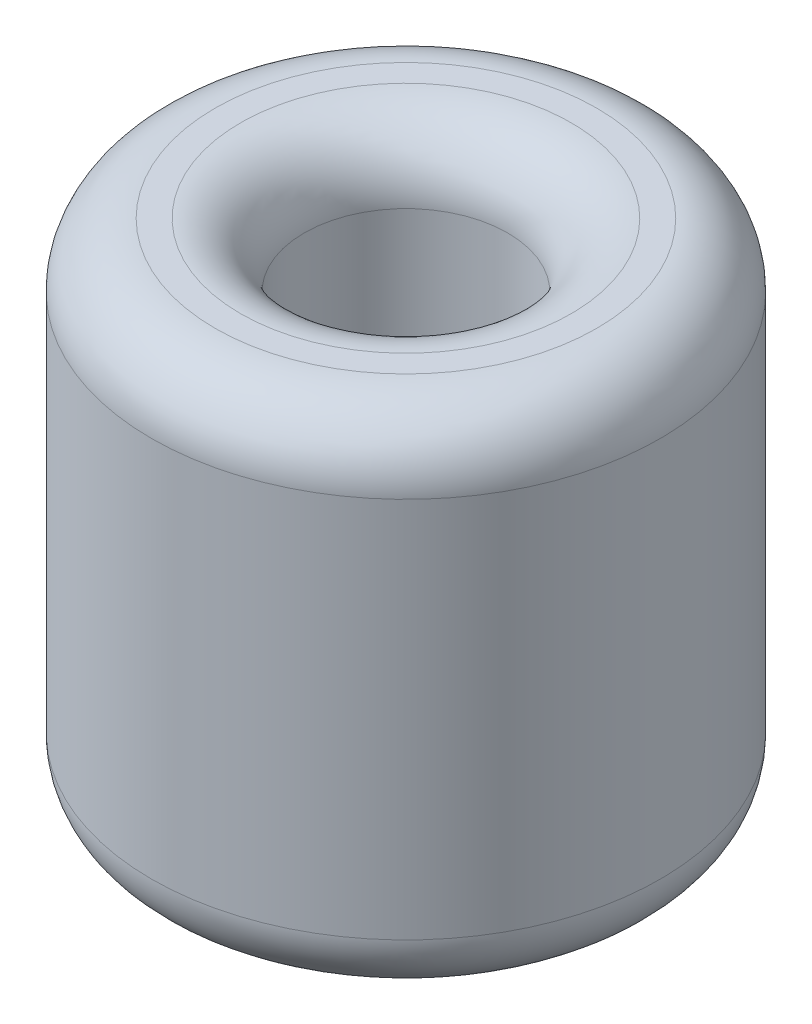
ISO-10303-21;
HEADER;
FILE_DESCRIPTION(('STEP AP214'),'2;1');
FILE_NAME('part.step','',(''),(''),'','','');
FILE_SCHEMA(('AUTOMOTIVE_DESIGN { 1 0 10303 214 1 1 1 1 }'));
ENDSEC;
DATA;
#1=APPLICATION_CONTEXT('core data for automotive mechanical design processes');
#2=APPLICATION_PROTOCOL_DEFINITION('international standard','automotive_design',2000,#1);
#3=PRODUCT_CONTEXT('',#1,'mechanical');
#4=PRODUCT('Part','Part','',(#3));
#5=PRODUCT_RELATED_PRODUCT_CATEGORY('part','',(#4));
#6=PRODUCT_DEFINITION_FORMATION('','',#4);
#7=PRODUCT_DEFINITION_CONTEXT('part definition',#1,'design');
#8=PRODUCT_DEFINITION('design','',#6,#7);
#9=PRODUCT_DEFINITION_SHAPE('','',#8);
#10=(LENGTH_UNIT() NAMED_UNIT(*) SI_UNIT(.MILLI.,.METRE.));
#11=(NAMED_UNIT(*) PLANE_ANGLE_UNIT() SI_UNIT($,.RADIAN.));
#12=(NAMED_UNIT(*) SI_UNIT($,.STERADIAN.) SOLID_ANGLE_UNIT());
#13=UNCERTAINTY_MEASURE_WITH_UNIT(LENGTH_MEASURE(1.E-05),#10,'distance_accuracy_value','');
#14=(GEOMETRIC_REPRESENTATION_CONTEXT(3) GLOBAL_UNCERTAINTY_ASSIGNED_CONTEXT((#13)) GLOBAL_UNIT_ASSIGNED_CONTEXT((#10,
#11,#12)) REPRESENTATION_CONTEXT('',''));
#15=CARTESIAN_POINT('',(0.,0.,0.));
#16=DIRECTION('',(0.,0.,1.));
#17=DIRECTION('',(1.,0.,0.));
#18=AXIS2_PLACEMENT_3D('',#15,#16,#17);
#19=CARTESIAN_POINT('',(0.,8.,0.));
#20=DIRECTION('',(0.,1.,0.));
#21=DIRECTION('',(0.,0.,1.));
#22=AXIS2_PLACEMENT_3D('',#19,#20,#21);
#23=PLANE('',#22);
#24=CARTESIAN_POINT('',(0.,8.,0.));
#25=DIRECTION('',(0.,1.,0.));
#26=DIRECTION('',(0.,0.,1.));
#27=AXIS2_PLACEMENT_3D('',#24,#25,#26);
#28=CIRCLE('',#27,3.);
#29=CARTESIAN_POINT('',(0.,8.,3.));
#30=VERTEX_POINT('',#29);
#31=EDGE_CURVE('E49',#30,#30,#28,.T.);
#32=ORIENTED_EDGE('',*,*,#31,.T.);
#33=EDGE_LOOP('',(#32));
#34=FACE_BOUND('',#33,.T.);
#35=CARTESIAN_POINT('',(0.,8.,0.));
#36=DIRECTION('',(0.,1.,0.));
#37=DIRECTION('',(0.,0.,1.));
#38=AXIS2_PLACEMENT_3D('',#35,#36,#37);
#39=CIRCLE('',#38,2.6);
#40=CARTESIAN_POINT('',(0.,8.,2.6));
#41=VERTEX_POINT('',#40);
#42=EDGE_CURVE('E54',#41,#41,#39,.F.);
#43=ORIENTED_EDGE('',*,*,#42,.T.);
#44=EDGE_LOOP('',(#43));
#45=FACE_BOUND('',#44,.T.);
#46=ADVANCED_FACE('F41',(#34,#45),#23,.T.);
#47=CARTESIAN_POINT('',(0.,0.,0.));
#48=DIRECTION('',(0.,1.,0.));
#49=DIRECTION('',(0.,0.,1.));
#50=AXIS2_PLACEMENT_3D('',#47,#48,#49);
#51=PLANE('',#50);
#52=CARTESIAN_POINT('',(0.,0.,0.));
#53=DIRECTION('',(0.,1.,0.));
#54=DIRECTION('',(0.,0.,1.));
#55=AXIS2_PLACEMENT_3D('',#52,#53,#54);
#56=CIRCLE('',#55,3.);
#57=CARTESIAN_POINT('',(0.,0.,3.));
#58=VERTEX_POINT('',#57);
#59=EDGE_CURVE('E59',#58,#58,#56,.F.);
#60=ORIENTED_EDGE('',*,*,#59,.T.);
#61=EDGE_LOOP('',(#60));
#62=FACE_BOUND('',#61,.T.);
#63=CARTESIAN_POINT('',(0.,0.,0.));
#64=DIRECTION('',(0.,1.,0.));
#65=DIRECTION('',(0.,0.,1.));
#66=AXIS2_PLACEMENT_3D('',#63,#64,#65);
#67=CIRCLE('',#66,1.6);
#68=CARTESIAN_POINT('',(0.,0.,1.6));
#69=VERTEX_POINT('',#68);
#70=EDGE_CURVE('E73',#69,#69,#67,.T.);
#71=ORIENTED_EDGE('',*,*,#70,.T.);
#72=EDGE_LOOP('',(#71));
#73=FACE_BOUND('',#72,.T.);
#74=ADVANCED_FACE('F78',(#62,#73),#51,.F.);
#75=CARTESIAN_POINT('',(0.,8.,0.));
#76=DIRECTION('',(0.,-1.,0.));
#77=DIRECTION('',(0.,0.,-1.));
#78=AXIS2_PLACEMENT_3D('',#75,#76,#77);
#79=CYLINDRICAL_SURFACE('',#78,4.);
#80=CARTESIAN_POINT('',(0.,1.,0.));
#81=DIRECTION('',(0.,1.,0.));
#82=DIRECTION('',(0.,0.,1.));
#83=AXIS2_PLACEMENT_3D('',#80,#81,#82);
#84=CIRCLE('',#83,4.);
#85=CARTESIAN_POINT('',(0.,1.,4.));
#86=VERTEX_POINT('',#85);
#87=EDGE_CURVE('E65',#86,#86,#84,.T.);
#88=ORIENTED_EDGE('',*,*,#87,.T.);
#89=EDGE_LOOP('',(#88));
#90=FACE_BOUND('',#89,.T.);
#91=CARTESIAN_POINT('',(0.,7.,0.));
#92=DIRECTION('',(0.,1.,0.));
#93=DIRECTION('',(0.,0.,1.));
#94=AXIS2_PLACEMENT_3D('',#91,#92,#93);
#95=CIRCLE('',#94,4.);
#96=CARTESIAN_POINT('',(0.,7.,4.));
#97=VERTEX_POINT('',#96);
#98=EDGE_CURVE('E69',#97,#97,#95,.F.);
#99=ORIENTED_EDGE('',*,*,#98,.T.);
#100=EDGE_LOOP('',(#99));
#101=FACE_BOUND('',#100,.T.);
#102=ADVANCED_FACE('F83',(#90,#101),#79,.T.);
#103=CARTESIAN_POINT('',(0.,8.,0.));
#104=DIRECTION('',(0.,-1.,0.));
#105=DIRECTION('',(0.,0.,-1.));
#106=AXIS2_PLACEMENT_3D('',#103,#104,#105);
#107=CYLINDRICAL_SURFACE('',#106,1.6);
#108=CARTESIAN_POINT('',(0.,7.,0.));
#109=DIRECTION('',(0.,1.,0.));
#110=DIRECTION('',(0.,0.,1.));
#111=AXIS2_PLACEMENT_3D('',#108,#109,#110);
#112=CIRCLE('',#111,1.6);
#113=CARTESIAN_POINT('',(0.,7.,1.6));
#114=VERTEX_POINT('',#113);
#115=EDGE_CURVE('E10',#114,#114,#112,.T.);
#116=ORIENTED_EDGE('',*,*,#115,.T.);
#117=EDGE_LOOP('',(#116));
#118=FACE_BOUND('',#117,.T.);
#119=ORIENTED_EDGE('',*,*,#70,.F.);
#120=EDGE_LOOP('',(#119));
#121=FACE_BOUND('',#120,.T.);
#122=ADVANCED_FACE('F80',(#118,#121),#107,.F.);
#123=CARTESIAN_POINT('',(0.,1.,0.));
#124=DIRECTION('',(0.,1.,0.));
#125=DIRECTION('',(0.,0.,1.));
#126=AXIS2_PLACEMENT_3D('',#123,#124,#125);
#127=TOROIDAL_SURFACE('',#126,3.,1.);
#128=ORIENTED_EDGE('',*,*,#59,.F.);
#129=EDGE_LOOP('',(#128));
#130=FACE_BOUND('',#129,.T.);
#131=ORIENTED_EDGE('',*,*,#87,.F.);
#132=EDGE_LOOP('',(#131));
#133=FACE_BOUND('',#132,.T.);
#134=ADVANCED_FACE('F82',(#130,#133),#127,.T.);
#135=CARTESIAN_POINT('',(0.,7.,0.));
#136=DIRECTION('',(0.,1.,0.));
#137=DIRECTION('',(0.,0.,1.));
#138=AXIS2_PLACEMENT_3D('',#135,#136,#137);
#139=TOROIDAL_SURFACE('',#138,3.,1.);
#140=ORIENTED_EDGE('',*,*,#98,.F.);
#141=EDGE_LOOP('',(#140));
#142=FACE_BOUND('',#141,.T.);
#143=ORIENTED_EDGE('',*,*,#31,.F.);
#144=EDGE_LOOP('',(#143));
#145=FACE_BOUND('',#144,.T.);
#146=ADVANCED_FACE('F89',(#142,#145),#139,.T.);
#147=CARTESIAN_POINT('',(0.,7.,0.));
#148=DIRECTION('',(0.,1.,0.));
#149=DIRECTION('',(0.,0.,1.));
#150=AXIS2_PLACEMENT_3D('',#147,#148,#149);
#151=TOROIDAL_SURFACE('',#150,2.6,1.);
#152=ORIENTED_EDGE('',*,*,#42,.F.);
#153=EDGE_LOOP('',(#152));
#154=FACE_BOUND('',#153,.T.);
#155=ORIENTED_EDGE('',*,*,#115,.F.);
#156=EDGE_LOOP('',(#155));
#157=FACE_BOUND('',#156,.T.);
#158=ADVANCED_FACE('F43',(#154,#157),#151,.T.);
#159=CLOSED_SHELL('',(#46,#74,#102,#122,#134,#146,#158));
#160=MANIFOLD_SOLID_BREP('B2',#159);
#161=ADVANCED_BREP_SHAPE_REPRESENTATION('',(#18,#160),#14);
#162=SHAPE_DEFINITION_REPRESENTATION(#9,#161);
ENDSEC;
END-ISO-10303-21;
